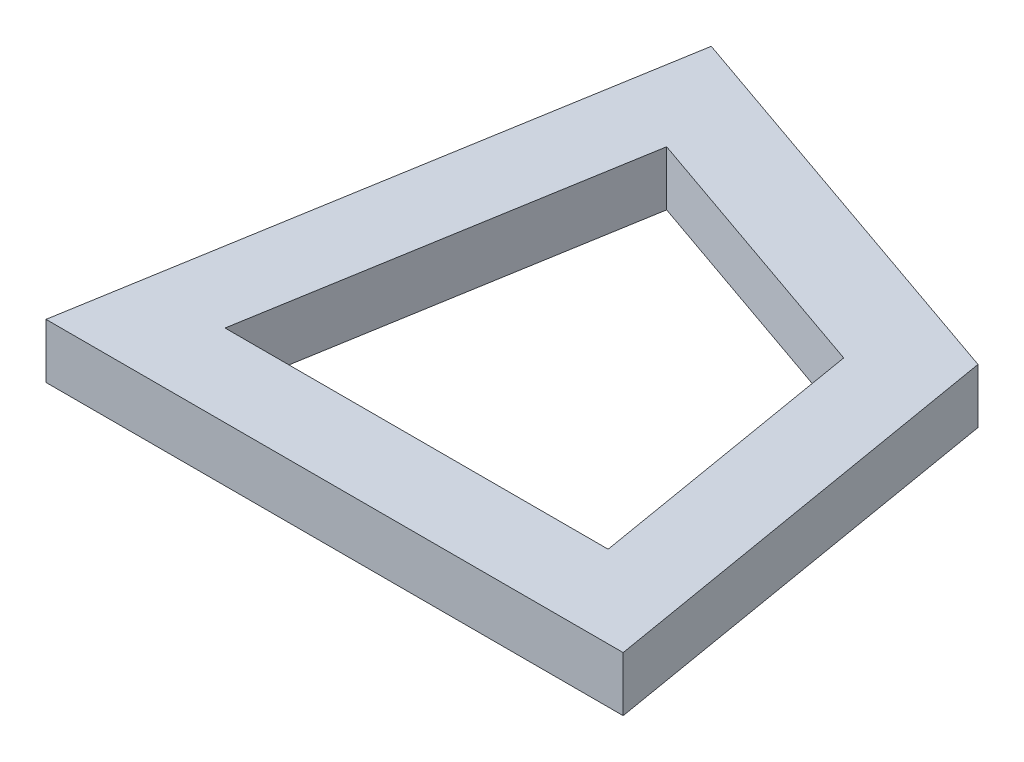
ISO-10303-21;
HEADER;
FILE_DESCRIPTION(('STEP AP214'),'2;1');
FILE_NAME('part.step','',(''),(''),'','','');
FILE_SCHEMA(('AUTOMOTIVE_DESIGN { 1 0 10303 214 1 1 1 1 }'));
ENDSEC;
DATA;
#1=APPLICATION_CONTEXT('core data for automotive mechanical design processes');
#2=APPLICATION_PROTOCOL_DEFINITION('international standard','automotive_design',2000,#1);
#3=PRODUCT_CONTEXT('',#1,'mechanical');
#4=PRODUCT('Part','Part','',(#3));
#5=PRODUCT_RELATED_PRODUCT_CATEGORY('part','',(#4));
#6=PRODUCT_DEFINITION_FORMATION('','',#4);
#7=PRODUCT_DEFINITION_CONTEXT('part definition',#1,'design');
#8=PRODUCT_DEFINITION('design','',#6,#7);
#9=PRODUCT_DEFINITION_SHAPE('','',#8);
#10=(LENGTH_UNIT() NAMED_UNIT(*) SI_UNIT(.MILLI.,.METRE.));
#11=(NAMED_UNIT(*) PLANE_ANGLE_UNIT() SI_UNIT($,.RADIAN.));
#12=(NAMED_UNIT(*) SI_UNIT($,.STERADIAN.) SOLID_ANGLE_UNIT());
#13=UNCERTAINTY_MEASURE_WITH_UNIT(LENGTH_MEASURE(1.E-05),#10,'distance_accuracy_value','');
#14=(GEOMETRIC_REPRESENTATION_CONTEXT(3) GLOBAL_UNCERTAINTY_ASSIGNED_CONTEXT((#13)) GLOBAL_UNIT_ASSIGNED_CONTEXT((#10,
#11,#12)) REPRESENTATION_CONTEXT('',''));
#15=CARTESIAN_POINT('',(0.,0.,0.));
#16=DIRECTION('',(0.,0.,1.));
#17=DIRECTION('',(1.,0.,0.));
#18=AXIS2_PLACEMENT_3D('',#15,#16,#17);
#19=CARTESIAN_POINT('',(0.,2.,0.));
#20=DIRECTION('',(0.,-1.,0.));
#21=DIRECTION('',(0.,0.,-1.));
#22=AXIS2_PLACEMENT_3D('',#19,#20,#21);
#23=PLANE('',#22);
#24=DIRECTION('',(-0.166596655404362,0.,0.986025128689974));
#25=VECTOR('',#24,1.);
#26=CARTESIAN_POINT('',(3.51755751052641,2.,-20.8191460301092));
#27=LINE('',#26,#25);
#28=CARTESIAN_POINT('',(3.51755751052641,2.,-20.8191460301092));
#29=VERTEX_POINT('',#28);
#30=CARTESIAN_POINT('',(0.,2.,0.));
#31=VERTEX_POINT('',#30);
#32=EDGE_CURVE('E140',#29,#31,#27,.T.);
#33=ORIENTED_EDGE('',*,*,#32,.T.);
#34=DIRECTION('',(1.,0.,0.));
#35=VECTOR('',#34,1.);
#36=CARTESIAN_POINT('',(0.,2.,0.));
#37=LINE('',#36,#35);
#38=CARTESIAN_POINT('',(21.11421446,2.,0.));
#39=VERTEX_POINT('',#38);
#40=EDGE_CURVE('E143',#31,#39,#37,.T.);
#41=ORIENTED_EDGE('',*,*,#40,.T.);
#42=DIRECTION('',(-0.166596655404362,0.,-0.986025128689974));
#43=VECTOR('',#42,1.);
#44=CARTESIAN_POINT('',(21.11421446,2.,0.));
#45=LINE('',#44,#43);
#46=CARTESIAN_POINT('',(18.475193449622,2.,-15.6194073948102));
#47=VERTEX_POINT('',#46);
#48=EDGE_CURVE('E146',#39,#47,#45,.T.);
#49=ORIENTED_EDGE('',*,*,#48,.T.);
#50=DIRECTION('',(-0.944553945341675,0.,-0.328356276534311));
#51=VECTOR('',#50,1.);
#52=CARTESIAN_POINT('',(18.475193449622,2.,-15.6194073948102));
#53=LINE('',#52,#51);
#54=EDGE_CURVE('E148',#47,#29,#53,.T.);
#55=ORIENTED_EDGE('',*,*,#54,.T.);
#56=EDGE_LOOP('',(#33,#41,#49,#55));
#57=FACE_BOUND('',#56,.T.);
#58=DIRECTION('',(-0.944553945341675,0.,-0.32835627653431));
#59=VECTOR('',#58,1.);
#60=CARTESIAN_POINT('',(15.8129342141059,2.,-13.3687890148426));
#61=LINE('',#60,#59);
#62=CARTESIAN_POINT('',(15.8129342141059,2.,-13.3687890148426));
#63=VERTEX_POINT('',#62);
#64=CARTESIAN_POINT('',(5.88443073402081,2.,-16.8202450702185));
#65=VERTEX_POINT('',#64);
#66=EDGE_CURVE('E104',#63,#65,#61,.T.);
#67=ORIENTED_EDGE('',*,*,#66,.F.);
#68=DIRECTION('',(-0.166596655404361,0.,-0.986025128689974));
#69=VECTOR('',#68,1.);
#70=CARTESIAN_POINT('',(17.5648221936357,2.,-3.));
#71=LINE('',#70,#69);
#72=CARTESIAN_POINT('',(17.5648221936357,2.,-3.));
#73=VERTEX_POINT('',#72);
#74=EDGE_CURVE('E126',#73,#63,#71,.T.);
#75=ORIENTED_EDGE('',*,*,#74,.F.);
#76=DIRECTION('',(1.,0.,0.));
#77=VECTOR('',#76,1.);
#78=CARTESIAN_POINT('',(3.54939226636433,2.,-3.));
#79=LINE('',#78,#77);
#80=CARTESIAN_POINT('',(3.54939226636433,2.,-3.));
#81=VERTEX_POINT('',#80);
#82=EDGE_CURVE('E124',#81,#73,#79,.T.);
#83=ORIENTED_EDGE('',*,*,#82,.F.);
#84=DIRECTION('',(-0.166596655404362,0.,0.986025128689974));
#85=VECTOR('',#84,1.);
#86=CARTESIAN_POINT('',(5.88443073402081,2.,-16.8202450702185));
#87=LINE('',#86,#85);
#88=EDGE_CURVE('E112',#65,#81,#87,.T.);
#89=ORIENTED_EDGE('',*,*,#88,.F.);
#90=EDGE_LOOP('',(#67,#75,#83,#89));
#91=FACE_BOUND('',#90,.T.);
#92=ADVANCED_FACE('F39',(#57,#91),#23,.F.);
#93=CARTESIAN_POINT('',(0.,0.,0.));
#94=DIRECTION('',(0.,-1.,0.));
#95=DIRECTION('',(0.,0.,-1.));
#96=AXIS2_PLACEMENT_3D('',#93,#94,#95);
#97=PLANE('',#96);
#98=DIRECTION('',(-0.166596655404362,0.,0.986025128689974));
#99=VECTOR('',#98,1.);
#100=CARTESIAN_POINT('',(3.51755751052641,0.,-20.8191460301092));
#101=LINE('',#100,#99);
#102=CARTESIAN_POINT('',(3.51755751052641,0.,-20.8191460301092));
#103=VERTEX_POINT('',#102);
#104=CARTESIAN_POINT('',(0.,0.,0.));
#105=VERTEX_POINT('',#104);
#106=EDGE_CURVE('E120',#103,#105,#101,.T.);
#107=ORIENTED_EDGE('',*,*,#106,.F.);
#108=DIRECTION('',(-0.944553945341675,0.,-0.328356276534311));
#109=VECTOR('',#108,1.);
#110=CARTESIAN_POINT('',(18.475193449622,0.,-15.6194073948102));
#111=LINE('',#110,#109);
#112=CARTESIAN_POINT('',(18.475193449622,0.,-15.6194073948102));
#113=VERTEX_POINT('',#112);
#114=EDGE_CURVE('E144',#113,#103,#111,.T.);
#115=ORIENTED_EDGE('',*,*,#114,.F.);
#116=DIRECTION('',(-0.166596655404362,0.,-0.986025128689974));
#117=VECTOR('',#116,1.);
#118=CARTESIAN_POINT('',(21.11421446,0.,0.));
#119=LINE('',#118,#117);
#120=CARTESIAN_POINT('',(21.11421446,0.,0.));
#121=VERTEX_POINT('',#120);
#122=EDGE_CURVE('E155',#121,#113,#119,.T.);
#123=ORIENTED_EDGE('',*,*,#122,.F.);
#124=DIRECTION('',(1.,0.,0.));
#125=VECTOR('',#124,1.);
#126=CARTESIAN_POINT('',(0.,0.,0.));
#127=LINE('',#126,#125);
#128=EDGE_CURVE('E153',#105,#121,#127,.T.);
#129=ORIENTED_EDGE('',*,*,#128,.F.);
#130=EDGE_LOOP('',(#107,#115,#123,#129));
#131=FACE_BOUND('',#130,.T.);
#132=DIRECTION('',(-0.166596655404361,0.,-0.986025128689974));
#133=VECTOR('',#132,1.);
#134=CARTESIAN_POINT('',(17.5648221936357,0.,-3.));
#135=LINE('',#134,#133);
#136=CARTESIAN_POINT('',(17.5648221936357,0.,-3.));
#137=VERTEX_POINT('',#136);
#138=CARTESIAN_POINT('',(15.8129342141059,0.,-13.3687890148426));
#139=VERTEX_POINT('',#138);
#140=EDGE_CURVE('E113',#137,#139,#135,.T.);
#141=ORIENTED_EDGE('',*,*,#140,.T.);
#142=DIRECTION('',(-0.944553945341675,0.,-0.32835627653431));
#143=VECTOR('',#142,1.);
#144=CARTESIAN_POINT('',(15.8129342141059,0.,-13.3687890148426));
#145=LINE('',#144,#143);
#146=CARTESIAN_POINT('',(5.88443073402081,0.,-16.8202450702185));
#147=VERTEX_POINT('',#146);
#148=EDGE_CURVE('E62',#139,#147,#145,.T.);
#149=ORIENTED_EDGE('',*,*,#148,.T.);
#150=DIRECTION('',(-0.166596655404362,0.,0.986025128689974));
#151=VECTOR('',#150,1.);
#152=CARTESIAN_POINT('',(5.88443073402081,0.,-16.8202450702185));
#153=LINE('',#152,#151);
#154=CARTESIAN_POINT('',(3.54939226636433,0.,-3.));
#155=VERTEX_POINT('',#154);
#156=EDGE_CURVE('E119',#147,#155,#153,.T.);
#157=ORIENTED_EDGE('',*,*,#156,.T.);
#158=DIRECTION('',(1.,0.,0.));
#159=VECTOR('',#158,1.);
#160=CARTESIAN_POINT('',(3.54939226636433,0.,-3.));
#161=LINE('',#160,#159);
#162=EDGE_CURVE('E132',#155,#137,#161,.T.);
#163=ORIENTED_EDGE('',*,*,#162,.T.);
#164=EDGE_LOOP('',(#141,#149,#157,#163));
#165=FACE_BOUND('',#164,.T.);
#166=ADVANCED_FACE('F173',(#131,#165),#97,.T.);
#167=CARTESIAN_POINT('',(3.51755751052641,2.,-20.8191460301092));
#168=DIRECTION('',(0.986025128689974,0.,0.166596655404362));
#169=DIRECTION('',(0.166596655404362,0.,-0.986025128689974));
#170=AXIS2_PLACEMENT_3D('',#167,#168,#169);
#171=PLANE('',#170);
#172=ORIENTED_EDGE('',*,*,#106,.T.);
#173=DIRECTION('',(0.,-1.,0.));
#174=VECTOR('',#173,1.);
#175=CARTESIAN_POINT('',(0.,2.,0.));
#176=LINE('',#175,#174);
#177=EDGE_CURVE('E11',#31,#105,#176,.T.);
#178=ORIENTED_EDGE('',*,*,#177,.F.);
#179=ORIENTED_EDGE('',*,*,#32,.F.);
#180=DIRECTION('',(0.,-1.,0.));
#181=VECTOR('',#180,1.);
#182=CARTESIAN_POINT('',(3.51755751052641,2.,-20.8191460301092));
#183=LINE('',#182,#181);
#184=EDGE_CURVE('E150',#29,#103,#183,.T.);
#185=ORIENTED_EDGE('',*,*,#184,.T.);
#186=EDGE_LOOP('',(#172,#178,#179,#185));
#187=FACE_BOUND('',#186,.T.);
#188=ADVANCED_FACE('F41',(#187),#171,.F.);
#189=CARTESIAN_POINT('',(0.,2.,0.));
#190=DIRECTION('',(0.,0.,-1.));
#191=DIRECTION('',(-1.,0.,0.));
#192=AXIS2_PLACEMENT_3D('',#189,#190,#191);
#193=PLANE('',#192);
#194=ORIENTED_EDGE('',*,*,#128,.T.);
#195=DIRECTION('',(0.,-1.,0.));
#196=VECTOR('',#195,1.);
#197=CARTESIAN_POINT('',(21.11421446,2.,0.));
#198=LINE('',#197,#196);
#199=EDGE_CURVE('E47',#39,#121,#198,.T.);
#200=ORIENTED_EDGE('',*,*,#199,.F.);
#201=ORIENTED_EDGE('',*,*,#40,.F.);
#202=ORIENTED_EDGE('',*,*,#177,.T.);
#203=EDGE_LOOP('',(#194,#200,#201,#202));
#204=FACE_BOUND('',#203,.T.);
#205=ADVANCED_FACE('F183',(#204),#193,.F.);
#206=CARTESIAN_POINT('',(21.11421446,2.,0.));
#207=DIRECTION('',(-0.986025128689974,0.,0.166596655404362));
#208=DIRECTION('',(0.166596655404362,0.,0.986025128689974));
#209=AXIS2_PLACEMENT_3D('',#206,#207,#208);
#210=PLANE('',#209);
#211=ORIENTED_EDGE('',*,*,#122,.T.);
#212=DIRECTION('',(0.,-1.,0.));
#213=VECTOR('',#212,1.);
#214=CARTESIAN_POINT('',(18.475193449622,2.,-15.6194073948102));
#215=LINE('',#214,#213);
#216=EDGE_CURVE('E160',#47,#113,#215,.T.);
#217=ORIENTED_EDGE('',*,*,#216,.F.);
#218=ORIENTED_EDGE('',*,*,#48,.F.);
#219=ORIENTED_EDGE('',*,*,#199,.T.);
#220=EDGE_LOOP('',(#211,#217,#218,#219));
#221=FACE_BOUND('',#220,.T.);
#222=ADVANCED_FACE('F167',(#221),#210,.F.);
#223=CARTESIAN_POINT('',(18.475193449622,2.,-15.6194073948102));
#224=DIRECTION('',(-0.328356276534311,0.,0.944553945341675));
#225=DIRECTION('',(0.944553945341675,0.,0.328356276534311));
#226=AXIS2_PLACEMENT_3D('',#223,#224,#225);
#227=PLANE('',#226);
#228=ORIENTED_EDGE('',*,*,#114,.T.);
#229=ORIENTED_EDGE('',*,*,#184,.F.);
#230=ORIENTED_EDGE('',*,*,#54,.F.);
#231=ORIENTED_EDGE('',*,*,#216,.T.);
#232=EDGE_LOOP('',(#228,#229,#230,#231));
#233=FACE_BOUND('',#232,.T.);
#234=ADVANCED_FACE('F177',(#233),#227,.F.);
#235=CARTESIAN_POINT('',(15.8129342141059,2.,-13.3687890148426));
#236=DIRECTION('',(-0.32835627653431,0.,0.944553945341675));
#237=DIRECTION('',(0.944553945341675,0.,0.32835627653431));
#238=AXIS2_PLACEMENT_3D('',#235,#236,#237);
#239=PLANE('',#238);
#240=ORIENTED_EDGE('',*,*,#148,.F.);
#241=DIRECTION('',(0.,-1.,0.));
#242=VECTOR('',#241,1.);
#243=CARTESIAN_POINT('',(15.8129342141059,2.,-13.3687890148426));
#244=LINE('',#243,#242);
#245=EDGE_CURVE('E108',#63,#139,#244,.T.);
#246=ORIENTED_EDGE('',*,*,#245,.F.);
#247=ORIENTED_EDGE('',*,*,#66,.T.);
#248=DIRECTION('',(0.,-1.,0.));
#249=VECTOR('',#248,1.);
#250=CARTESIAN_POINT('',(5.88443073402081,2.,-16.8202450702185));
#251=LINE('',#250,#249);
#252=EDGE_CURVE('E107',#65,#147,#251,.T.);
#253=ORIENTED_EDGE('',*,*,#252,.T.);
#254=EDGE_LOOP('',(#240,#246,#247,#253));
#255=FACE_BOUND('',#254,.T.);
#256=ADVANCED_FACE('F106',(#255),#239,.T.);
#257=CARTESIAN_POINT('',(5.88443073402081,2.,-16.8202450702185));
#258=DIRECTION('',(0.986025128689974,0.,0.166596655404362));
#259=DIRECTION('',(0.166596655404362,0.,-0.986025128689974));
#260=AXIS2_PLACEMENT_3D('',#257,#258,#259);
#261=PLANE('',#260);
#262=ORIENTED_EDGE('',*,*,#156,.F.);
#263=ORIENTED_EDGE('',*,*,#252,.F.);
#264=ORIENTED_EDGE('',*,*,#88,.T.);
#265=DIRECTION('',(0.,-1.,0.));
#266=VECTOR('',#265,1.);
#267=CARTESIAN_POINT('',(3.54939226636433,2.,-3.));
#268=LINE('',#267,#266);
#269=EDGE_CURVE('E121',#81,#155,#268,.T.);
#270=ORIENTED_EDGE('',*,*,#269,.T.);
#271=EDGE_LOOP('',(#262,#263,#264,#270));
#272=FACE_BOUND('',#271,.T.);
#273=ADVANCED_FACE('F116',(#272),#261,.T.);
#274=CARTESIAN_POINT('',(3.54939226636433,2.,-3.));
#275=DIRECTION('',(0.,0.,-1.));
#276=DIRECTION('',(-1.,0.,0.));
#277=AXIS2_PLACEMENT_3D('',#274,#275,#276);
#278=PLANE('',#277);
#279=ORIENTED_EDGE('',*,*,#162,.F.);
#280=ORIENTED_EDGE('',*,*,#269,.F.);
#281=ORIENTED_EDGE('',*,*,#82,.T.);
#282=DIRECTION('',(0.,-1.,0.));
#283=VECTOR('',#282,1.);
#284=CARTESIAN_POINT('',(17.5648221936357,2.,-3.));
#285=LINE('',#284,#283);
#286=EDGE_CURVE('E54',#73,#137,#285,.T.);
#287=ORIENTED_EDGE('',*,*,#286,.T.);
#288=EDGE_LOOP('',(#279,#280,#281,#287));
#289=FACE_BOUND('',#288,.T.);
#290=ADVANCED_FACE('F206',(#289),#278,.T.);
#291=CARTESIAN_POINT('',(17.5648221936357,2.,-3.));
#292=DIRECTION('',(-0.986025128689974,0.,0.166596655404361));
#293=DIRECTION('',(0.166596655404361,0.,0.986025128689974));
#294=AXIS2_PLACEMENT_3D('',#291,#292,#293);
#295=PLANE('',#294);
#296=ORIENTED_EDGE('',*,*,#140,.F.);
#297=ORIENTED_EDGE('',*,*,#286,.F.);
#298=ORIENTED_EDGE('',*,*,#74,.T.);
#299=ORIENTED_EDGE('',*,*,#245,.T.);
#300=EDGE_LOOP('',(#296,#297,#298,#299));
#301=FACE_BOUND('',#300,.T.);
#302=ADVANCED_FACE('F210',(#301),#295,.T.);
#303=CLOSED_SHELL('',(#92,#166,#188,#205,#222,#234,#256,#273,#290,#302));
#304=MANIFOLD_SOLID_BREP('B2',#303);
#305=ADVANCED_BREP_SHAPE_REPRESENTATION('',(#18,#304),#14);
#306=SHAPE_DEFINITION_REPRESENTATION(#9,#305);
ENDSEC;
END-ISO-10303-21;
